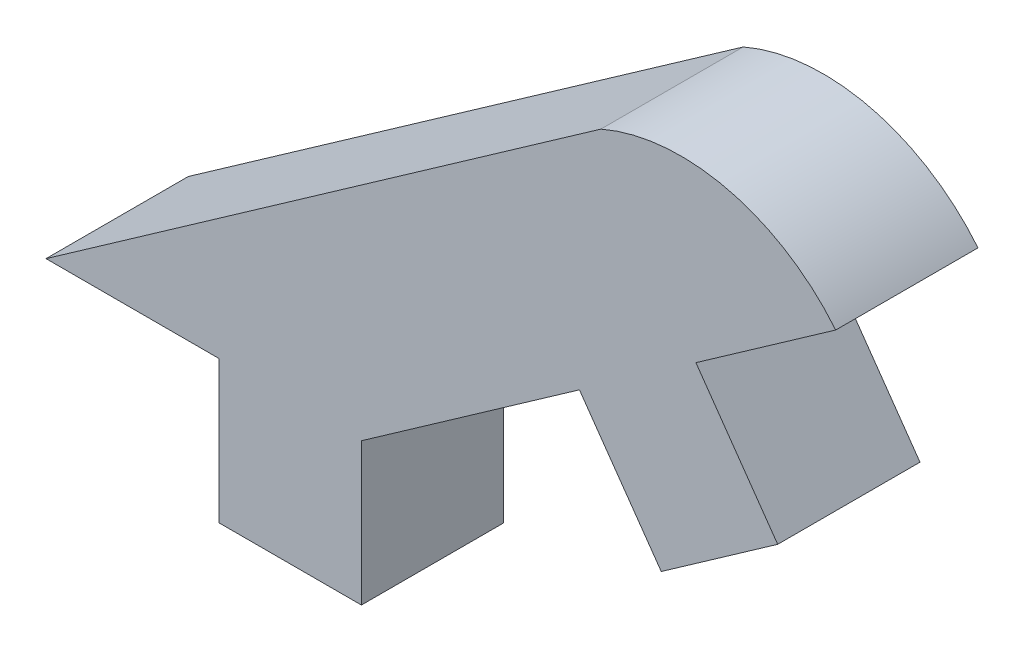
ISO-10303-21;
HEADER;
FILE_DESCRIPTION(('STEP AP214'),'2;1');
FILE_NAME('part.step','',(''),(''),'','','');
FILE_SCHEMA(('AUTOMOTIVE_DESIGN { 1 0 10303 214 1 1 1 1 }'));
ENDSEC;
DATA;
#1=APPLICATION_CONTEXT('core data for automotive mechanical design processes');
#2=APPLICATION_PROTOCOL_DEFINITION('international standard','automotive_design',2000,#1);
#3=PRODUCT_CONTEXT('',#1,'mechanical');
#4=PRODUCT('Part','Part','',(#3));
#5=PRODUCT_RELATED_PRODUCT_CATEGORY('part','',(#4));
#6=PRODUCT_DEFINITION_FORMATION('','',#4);
#7=PRODUCT_DEFINITION_CONTEXT('part definition',#1,'design');
#8=PRODUCT_DEFINITION('design','',#6,#7);
#9=PRODUCT_DEFINITION_SHAPE('','',#8);
#10=(LENGTH_UNIT() NAMED_UNIT(*) SI_UNIT(.MILLI.,.METRE.));
#11=(NAMED_UNIT(*) PLANE_ANGLE_UNIT() SI_UNIT($,.RADIAN.));
#12=(NAMED_UNIT(*) SI_UNIT($,.STERADIAN.) SOLID_ANGLE_UNIT());
#13=UNCERTAINTY_MEASURE_WITH_UNIT(LENGTH_MEASURE(1.E-05),#10,'distance_accuracy_value','');
#14=(GEOMETRIC_REPRESENTATION_CONTEXT(3) GLOBAL_UNCERTAINTY_ASSIGNED_CONTEXT((#13)) GLOBAL_UNIT_ASSIGNED_CONTEXT((#10,
#11,#12)) REPRESENTATION_CONTEXT('',''));
#15=CARTESIAN_POINT('',(0.,0.,0.));
#16=DIRECTION('',(0.,0.,1.));
#17=DIRECTION('',(1.,0.,0.));
#18=AXIS2_PLACEMENT_3D('',#15,#16,#17);
#19=CARTESIAN_POINT('',(26.7035857156091,0.,1.524));
#20=DIRECTION('',(0.,1.,0.));
#21=DIRECTION('',(0.,0.,1.));
#22=AXIS2_PLACEMENT_3D('',#19,#20,#21);
#23=PLANE('',#22);
#24=DIRECTION('',(1.,0.,0.));
#25=VECTOR('',#24,1.);
#26=CARTESIAN_POINT('',(26.7035857156091,0.,0.));
#27=LINE('',#26,#25);
#28=CARTESIAN_POINT('',(24.8496568898418,0.,0.));
#29=VERTEX_POINT('',#28);
#30=CARTESIAN_POINT('',(26.7035857156091,0.,0.));
#31=VERTEX_POINT('',#30);
#32=EDGE_CURVE('E148',#29,#31,#27,.T.);
#33=ORIENTED_EDGE('',*,*,#32,.T.);
#34=DIRECTION('',(0.,0.,-1.));
#35=VECTOR('',#34,1.);
#36=CARTESIAN_POINT('',(26.7035857156091,0.,1.524));
#37=LINE('',#36,#35);
#38=CARTESIAN_POINT('',(26.7035857156091,0.,1.524));
#39=VERTEX_POINT('',#38);
#40=EDGE_CURVE('E11',#39,#31,#37,.T.);
#41=ORIENTED_EDGE('',*,*,#40,.F.);
#42=DIRECTION('',(1.,0.,0.));
#43=VECTOR('',#42,1.);
#44=CARTESIAN_POINT('',(26.7035857156091,0.,1.524));
#45=LINE('',#44,#43);
#46=CARTESIAN_POINT('',(24.8496568898418,0.,1.524));
#47=VERTEX_POINT('',#46);
#48=EDGE_CURVE('E168',#47,#39,#45,.T.);
#49=ORIENTED_EDGE('',*,*,#48,.F.);
#50=DIRECTION('',(0.,0.,-1.));
#51=VECTOR('',#50,1.);
#52=CARTESIAN_POINT('',(24.8496568898418,0.,1.524));
#53=LINE('',#52,#51);
#54=EDGE_CURVE('E144',#47,#29,#53,.T.);
#55=ORIENTED_EDGE('',*,*,#54,.T.);
#56=EDGE_LOOP('',(#33,#41,#49,#55));
#57=FACE_BOUND('',#56,.T.);
#58=ADVANCED_FACE('F34',(#57),#23,.F.);
#59=CARTESIAN_POINT('',(26.7035857156091,0.,1.524));
#60=DIRECTION('',(1.,0.,0.));
#61=DIRECTION('',(0.,0.,-1.));
#62=AXIS2_PLACEMENT_3D('',#59,#60,#61);
#63=PLANE('',#62);
#64=DIRECTION('',(0.,-1.,0.));
#65=VECTOR('',#64,1.);
#66=CARTESIAN_POINT('',(26.7035857156091,0.,0.));
#67=LINE('',#66,#65);
#68=CARTESIAN_POINT('',(26.7035857156091,-1.524,0.));
#69=VERTEX_POINT('',#68);
#70=EDGE_CURVE('E151',#31,#69,#67,.T.);
#71=ORIENTED_EDGE('',*,*,#70,.T.);
#72=DIRECTION('',(0.,0.,-1.));
#73=VECTOR('',#72,1.);
#74=CARTESIAN_POINT('',(26.7035857156091,-1.524,1.524));
#75=LINE('',#74,#73);
#76=CARTESIAN_POINT('',(26.7035857156091,-1.524,1.524));
#77=VERTEX_POINT('',#76);
#78=EDGE_CURVE('E42',#77,#69,#75,.T.);
#79=ORIENTED_EDGE('',*,*,#78,.F.);
#80=DIRECTION('',(0.,-1.,0.));
#81=VECTOR('',#80,1.);
#82=CARTESIAN_POINT('',(26.7035857156091,0.,1.524));
#83=LINE('',#82,#81);
#84=EDGE_CURVE('E102',#39,#77,#83,.T.);
#85=ORIENTED_EDGE('',*,*,#84,.F.);
#86=ORIENTED_EDGE('',*,*,#40,.T.);
#87=EDGE_LOOP('',(#71,#79,#85,#86));
#88=FACE_BOUND('',#87,.T.);
#89=ADVANCED_FACE('F240',(#88),#63,.F.);
#90=CARTESIAN_POINT('',(26.7035857156091,-1.524,1.524));
#91=DIRECTION('',(0.,1.,0.));
#92=DIRECTION('',(0.,0.,1.));
#93=AXIS2_PLACEMENT_3D('',#90,#91,#92);
#94=PLANE('',#93);
#95=DIRECTION('',(1.,0.,0.));
#96=VECTOR('',#95,1.);
#97=CARTESIAN_POINT('',(26.7035857156091,-1.524,0.));
#98=LINE('',#97,#96);
#99=CARTESIAN_POINT('',(28.2275857156091,-1.524,0.));
#100=VERTEX_POINT('',#99);
#101=EDGE_CURVE('E153',#69,#100,#98,.T.);
#102=ORIENTED_EDGE('',*,*,#101,.T.);
#103=DIRECTION('',(0.,0.,-1.));
#104=VECTOR('',#103,1.);
#105=CARTESIAN_POINT('',(28.2275857156091,-1.524,1.524));
#106=LINE('',#105,#104);
#107=CARTESIAN_POINT('',(28.2275857156091,-1.524,1.524));
#108=VERTEX_POINT('',#107);
#109=EDGE_CURVE('E184',#108,#100,#106,.T.);
#110=ORIENTED_EDGE('',*,*,#109,.F.);
#111=DIRECTION('',(1.,0.,0.));
#112=VECTOR('',#111,1.);
#113=CARTESIAN_POINT('',(26.7035857156091,-1.524,1.524));
#114=LINE('',#113,#112);
#115=EDGE_CURVE('E192',#77,#108,#114,.T.);
#116=ORIENTED_EDGE('',*,*,#115,.F.);
#117=ORIENTED_EDGE('',*,*,#78,.T.);
#118=EDGE_LOOP('',(#102,#110,#116,#117));
#119=FACE_BOUND('',#118,.T.);
#120=ADVANCED_FACE('F190',(#119),#94,.F.);
#121=CARTESIAN_POINT('',(28.2275857156091,-1.524,1.524));
#122=DIRECTION('',(-1.,0.,0.));
#123=DIRECTION('',(0.,0.,1.));
#124=AXIS2_PLACEMENT_3D('',#121,#122,#123);
#125=PLANE('',#124);
#126=DIRECTION('',(0.,1.,0.));
#127=VECTOR('',#126,1.);
#128=CARTESIAN_POINT('',(28.2275857156091,-1.524,0.));
#129=LINE('',#128,#127);
#130=CARTESIAN_POINT('',(28.2275857156091,0.,0.));
#131=VERTEX_POINT('',#130);
#132=EDGE_CURVE('E155',#100,#131,#129,.T.);
#133=ORIENTED_EDGE('',*,*,#132,.T.);
#134=DIRECTION('',(0.,0.,-1.));
#135=VECTOR('',#134,1.);
#136=CARTESIAN_POINT('',(28.2275857156091,0.,1.524));
#137=LINE('',#136,#135);
#138=CARTESIAN_POINT('',(28.2275857156091,0.,1.524));
#139=VERTEX_POINT('',#138);
#140=EDGE_CURVE('E181',#139,#131,#137,.T.);
#141=ORIENTED_EDGE('',*,*,#140,.F.);
#142=DIRECTION('',(0.,1.,0.));
#143=VECTOR('',#142,1.);
#144=CARTESIAN_POINT('',(28.2275857156091,-1.524,1.524));
#145=LINE('',#144,#143);
#146=EDGE_CURVE('E210',#108,#139,#145,.T.);
#147=ORIENTED_EDGE('',*,*,#146,.F.);
#148=ORIENTED_EDGE('',*,*,#109,.T.);
#149=EDGE_LOOP('',(#133,#141,#147,#148));
#150=FACE_BOUND('',#149,.T.);
#151=ADVANCED_FACE('F201',(#150),#125,.F.);
#152=CARTESIAN_POINT('',(28.2275857156091,0.,1.524));
#153=DIRECTION('',(-0.574647327219023,0.818401154275843,0.));
#154=DIRECTION('',(-0.818401154275843,-0.574647327219023,0.));
#155=AXIS2_PLACEMENT_3D('',#152,#153,#154);
#156=PLANE('',#155);
#157=DIRECTION('',(0.818401154275843,0.574647327219023,0.));
#158=VECTOR('',#157,1.);
#159=CARTESIAN_POINT('',(28.2275857156091,0.,0.));
#160=LINE('',#159,#158);
#161=CARTESIAN_POINT('',(30.5627544392451,1.63965856918935,0.));
#162=VERTEX_POINT('',#161);
#163=EDGE_CURVE('E157',#131,#162,#160,.T.);
#164=ORIENTED_EDGE('',*,*,#163,.T.);
#165=DIRECTION('',(0.,0.,-1.));
#166=VECTOR('',#165,1.);
#167=CARTESIAN_POINT('',(30.5627544392451,1.63965856918935,1.524));
#168=LINE('',#167,#166);
#169=CARTESIAN_POINT('',(30.5627544392451,1.63965856918935,1.524));
#170=VERTEX_POINT('',#169);
#171=EDGE_CURVE('E178',#170,#162,#168,.T.);
#172=ORIENTED_EDGE('',*,*,#171,.F.);
#173=DIRECTION('',(0.818401154275843,0.574647327219023,0.));
#174=VECTOR('',#173,1.);
#175=CARTESIAN_POINT('',(28.2275857156091,0.,1.524));
#176=LINE('',#175,#174);
#177=EDGE_CURVE('E207',#139,#170,#176,.T.);
#178=ORIENTED_EDGE('',*,*,#177,.F.);
#179=ORIENTED_EDGE('',*,*,#140,.T.);
#180=EDGE_LOOP('',(#164,#172,#178,#179));
#181=FACE_BOUND('',#180,.T.);
#182=ADVANCED_FACE('F205',(#181),#156,.F.);
#183=CARTESIAN_POINT('',(30.5627544392451,1.63965856918935,1.524));
#184=DIRECTION('',(0.818401154275843,0.574647327219023,0.));
#185=DIRECTION('',(-0.574647327219023,0.818401154275843,0.));
#186=AXIS2_PLACEMENT_3D('',#183,#184,#185);
#187=PLANE('',#186);
#188=DIRECTION('',(0.574647327219023,-0.818401154275843,0.));
#189=VECTOR('',#188,1.);
#190=CARTESIAN_POINT('',(30.5627544392451,1.63965856918935,0.));
#191=LINE('',#190,#189);
#192=CARTESIAN_POINT('',(31.4385169659268,0.392415210072967,0.));
#193=VERTEX_POINT('',#192);
#194=EDGE_CURVE('E159',#162,#193,#191,.T.);
#195=ORIENTED_EDGE('',*,*,#194,.T.);
#196=DIRECTION('',(0.,0.,-1.));
#197=VECTOR('',#196,1.);
#198=CARTESIAN_POINT('',(31.4385169659268,0.392415210072967,1.524));
#199=LINE('',#198,#197);
#200=CARTESIAN_POINT('',(31.4385169659268,0.392415210072967,1.524));
#201=VERTEX_POINT('',#200);
#202=EDGE_CURVE('E175',#201,#193,#199,.T.);
#203=ORIENTED_EDGE('',*,*,#202,.F.);
#204=DIRECTION('',(0.574647327219023,-0.818401154275843,0.));
#205=VECTOR('',#204,1.);
#206=CARTESIAN_POINT('',(30.5627544392451,1.63965856918935,1.524));
#207=LINE('',#206,#205);
#208=EDGE_CURVE('E209',#170,#201,#207,.T.);
#209=ORIENTED_EDGE('',*,*,#208,.F.);
#210=ORIENTED_EDGE('',*,*,#171,.T.);
#211=EDGE_LOOP('',(#195,#203,#209,#210));
#212=FACE_BOUND('',#211,.T.);
#213=ADVANCED_FACE('F253',(#212),#187,.F.);
#214=CARTESIAN_POINT('',(31.4385169659268,0.392415210072967,1.524));
#215=DIRECTION('',(-0.574647327219024,0.818401154275843,0.));
#216=DIRECTION('',(-0.818401154275843,-0.574647327219024,0.));
#217=AXIS2_PLACEMENT_3D('',#214,#215,#216);
#218=PLANE('',#217);
#219=DIRECTION('',(0.818401154275843,0.574647327219024,0.));
#220=VECTOR('',#219,1.);
#221=CARTESIAN_POINT('',(31.4385169659268,0.392415210072967,0.));
#222=LINE('',#221,#220);
#223=CARTESIAN_POINT('',(32.6857603250432,1.26817773675476,0.));
#224=VERTEX_POINT('',#223);
#225=EDGE_CURVE('E161',#193,#224,#222,.T.);
#226=ORIENTED_EDGE('',*,*,#225,.T.);
#227=DIRECTION('',(0.,0.,-1.));
#228=VECTOR('',#227,1.);
#229=CARTESIAN_POINT('',(32.6857603250432,1.26817773675476,1.524));
#230=LINE('',#229,#228);
#231=CARTESIAN_POINT('',(32.6857603250432,1.26817773675476,1.524));
#232=VERTEX_POINT('',#231);
#233=EDGE_CURVE('E172',#232,#224,#230,.T.);
#234=ORIENTED_EDGE('',*,*,#233,.F.);
#235=DIRECTION('',(0.818401154275843,0.574647327219024,0.));
#236=VECTOR('',#235,1.);
#237=CARTESIAN_POINT('',(31.4385169659268,0.392415210072967,1.524));
#238=LINE('',#237,#236);
#239=EDGE_CURVE('E212',#201,#232,#238,.T.);
#240=ORIENTED_EDGE('',*,*,#239,.F.);
#241=ORIENTED_EDGE('',*,*,#202,.T.);
#242=EDGE_LOOP('',(#226,#234,#240,#241));
#243=FACE_BOUND('',#242,.T.);
#244=ADVANCED_FACE('F221',(#243),#218,.F.);
#245=CARTESIAN_POINT('',(32.6857603250432,1.26817773675476,1.524));
#246=DIRECTION('',(-0.818401154275844,-0.574647327219022,0.));
#247=DIRECTION('',(0.574647327219022,-0.818401154275844,0.));
#248=AXIS2_PLACEMENT_3D('',#245,#246,#247);
#249=PLANE('',#248);
#250=DIRECTION('',(-0.574647327219022,0.818401154275844,0.));
#251=VECTOR('',#250,1.);
#252=CARTESIAN_POINT('',(32.6857603250432,1.26817773675476,0.));
#253=LINE('',#252,#251);
#254=CARTESIAN_POINT('',(31.8099977983614,2.51542109587115,0.));
#255=VERTEX_POINT('',#254);
#256=EDGE_CURVE('E163',#224,#255,#253,.T.);
#257=ORIENTED_EDGE('',*,*,#256,.T.);
#258=DIRECTION('',(0.,0.,-1.));
#259=VECTOR('',#258,1.);
#260=CARTESIAN_POINT('',(31.8099977983614,2.51542109587115,1.524));
#261=LINE('',#260,#259);
#262=CARTESIAN_POINT('',(31.8099977983614,2.51542109587115,1.524));
#263=VERTEX_POINT('',#262);
#264=EDGE_CURVE('E139',#263,#255,#261,.T.);
#265=ORIENTED_EDGE('',*,*,#264,.F.);
#266=DIRECTION('',(-0.574647327219022,0.818401154275844,0.));
#267=VECTOR('',#266,1.);
#268=CARTESIAN_POINT('',(32.6857603250432,1.26817773675476,1.524));
#269=LINE('',#268,#267);
#270=EDGE_CURVE('E130',#232,#263,#269,.T.);
#271=ORIENTED_EDGE('',*,*,#270,.F.);
#272=ORIENTED_EDGE('',*,*,#233,.T.);
#273=EDGE_LOOP('',(#257,#265,#271,#272));
#274=FACE_BOUND('',#273,.T.);
#275=ADVANCED_FACE('F225',(#274),#249,.F.);
#276=CARTESIAN_POINT('',(31.8099977983614,2.51542109587115,1.524));
#277=DIRECTION('',(-0.574647327219024,0.818401154275843,0.));
#278=DIRECTION('',(-0.818401154275843,-0.574647327219024,0.));
#279=AXIS2_PLACEMENT_3D('',#276,#277,#278);
#280=PLANE('',#279);
#281=DIRECTION('',(0.818401154275843,0.574647327219024,0.));
#282=VECTOR('',#281,1.);
#283=CARTESIAN_POINT('',(31.8099977983614,2.51542109587115,0.));
#284=LINE('',#283,#282);
#285=CARTESIAN_POINT('',(33.3069658175326,3.56652991537204,0.));
#286=VERTEX_POINT('',#285);
#287=EDGE_CURVE('E138',#255,#286,#284,.T.);
#288=ORIENTED_EDGE('',*,*,#287,.T.);
#289=DIRECTION('',(0.,0.,-1.));
#290=VECTOR('',#289,1.);
#291=CARTESIAN_POINT('',(33.3069658175326,3.56652991537204,1.524));
#292=LINE('',#291,#290);
#293=CARTESIAN_POINT('',(33.3069658175326,3.56652991537204,1.524));
#294=VERTEX_POINT('',#293);
#295=EDGE_CURVE('E135',#294,#286,#292,.T.);
#296=ORIENTED_EDGE('',*,*,#295,.F.);
#297=DIRECTION('',(0.818401154275843,0.574647327219024,0.));
#298=VECTOR('',#297,1.);
#299=CARTESIAN_POINT('',(31.8099977983614,2.51542109587115,1.524));
#300=LINE('',#299,#298);
#301=EDGE_CURVE('E124',#263,#294,#300,.T.);
#302=ORIENTED_EDGE('',*,*,#301,.F.);
#303=ORIENTED_EDGE('',*,*,#264,.T.);
#304=EDGE_LOOP('',(#288,#296,#302,#303));
#305=FACE_BOUND('',#304,.T.);
#306=ADVANCED_FACE('F136',(#305),#280,.F.);
#307=CARTESIAN_POINT('',(31.6507784793167,2.21503572462214,1.524));
#308=DIRECTION('',(0.,0.,-1.));
#309=DIRECTION('',(-1.,0.,0.));
#310=AXIS2_PLACEMENT_3D('',#307,#308,#309);
#311=CYLINDRICAL_SURFACE('',#310,2.13763725802519);
#312=CARTESIAN_POINT('',(31.6507784793167,2.21503572462214,0.));
#313=DIRECTION('',(0.,0.,1.));
#314=DIRECTION('',(1.,0.,0.));
#315=AXIS2_PLACEMENT_3D('',#312,#313,#314);
#316=CIRCLE('',#315,2.13763725802519);
#317=CARTESIAN_POINT('',(30.7924423059396,4.17277729601755,0.));
#318=VERTEX_POINT('',#317);
#319=EDGE_CURVE('E88',#286,#318,#316,.T.);
#320=ORIENTED_EDGE('',*,*,#319,.T.);
#321=DIRECTION('',(0.,0.,-1.));
#322=VECTOR('',#321,1.);
#323=CARTESIAN_POINT('',(30.7924423059396,4.17277729601755,1.524));
#324=LINE('',#323,#322);
#325=CARTESIAN_POINT('',(30.7924423059396,4.17277729601755,1.524));
#326=VERTEX_POINT('',#325);
#327=EDGE_CURVE('E140',#326,#318,#324,.T.);
#328=ORIENTED_EDGE('',*,*,#327,.F.);
#329=CARTESIAN_POINT('',(31.6507784793167,2.21503572462214,1.524));
#330=DIRECTION('',(0.,0.,1.));
#331=DIRECTION('',(1.,0.,0.));
#332=AXIS2_PLACEMENT_3D('',#329,#330,#331);
#333=CIRCLE('',#332,2.13763725802519);
#334=EDGE_CURVE('E128',#294,#326,#333,.T.);
#335=ORIENTED_EDGE('',*,*,#334,.F.);
#336=ORIENTED_EDGE('',*,*,#295,.T.);
#337=EDGE_LOOP('',(#320,#328,#335,#336));
#338=FACE_BOUND('',#337,.T.);
#339=ADVANCED_FACE('F142',(#338),#311,.T.);
#340=CARTESIAN_POINT('',(24.8496568898418,0.,1.524));
#341=DIRECTION('',(0.574647327219023,-0.818401154275843,0.));
#342=DIRECTION('',(0.818401154275843,0.574647327219023,0.));
#343=AXIS2_PLACEMENT_3D('',#340,#341,#342);
#344=PLANE('',#343);
#345=DIRECTION('',(-0.818401154275843,-0.574647327219023,0.));
#346=VECTOR('',#345,1.);
#347=CARTESIAN_POINT('',(24.8496568898418,0.,0.));
#348=LINE('',#347,#346);
#349=EDGE_CURVE('E94',#318,#29,#348,.T.);
#350=ORIENTED_EDGE('',*,*,#349,.T.);
#351=ORIENTED_EDGE('',*,*,#54,.F.);
#352=DIRECTION('',(-0.818401154275843,-0.574647327219023,0.));
#353=VECTOR('',#352,1.);
#354=CARTESIAN_POINT('',(24.8496568898418,0.,1.524));
#355=LINE('',#354,#353);
#356=EDGE_CURVE('E50',#326,#47,#355,.T.);
#357=ORIENTED_EDGE('',*,*,#356,.F.);
#358=ORIENTED_EDGE('',*,*,#327,.T.);
#359=EDGE_LOOP('',(#350,#351,#357,#358));
#360=FACE_BOUND('',#359,.T.);
#361=ADVANCED_FACE('F229',(#360),#344,.F.);
#362=CARTESIAN_POINT('',(31.6507784793167,2.21503572462214,1.524));
#363=DIRECTION('',(0.,0.,1.));
#364=DIRECTION('',(1.,0.,0.));
#365=AXIS2_PLACEMENT_3D('',#362,#363,#364);
#366=PLANE('',#365);
#367=ORIENTED_EDGE('',*,*,#48,.T.);
#368=ORIENTED_EDGE('',*,*,#84,.T.);
#369=ORIENTED_EDGE('',*,*,#115,.T.);
#370=ORIENTED_EDGE('',*,*,#146,.T.);
#371=ORIENTED_EDGE('',*,*,#177,.T.);
#372=ORIENTED_EDGE('',*,*,#208,.T.);
#373=ORIENTED_EDGE('',*,*,#239,.T.);
#374=ORIENTED_EDGE('',*,*,#270,.T.);
#375=ORIENTED_EDGE('',*,*,#301,.T.);
#376=ORIENTED_EDGE('',*,*,#334,.T.);
#377=ORIENTED_EDGE('',*,*,#356,.T.);
#378=EDGE_LOOP('',(#367,#368,#369,#370,#371,#372,#373,#374,#375,#376,#377));
#379=FACE_BOUND('',#378,.T.);
#380=ADVANCED_FACE('F126',(#379),#366,.T.);
#381=CARTESIAN_POINT('',(31.6507784793167,2.21503572462214,0.));
#382=DIRECTION('',(0.,0.,1.));
#383=DIRECTION('',(1.,0.,0.));
#384=AXIS2_PLACEMENT_3D('',#381,#382,#383);
#385=PLANE('',#384);
#386=ORIENTED_EDGE('',*,*,#32,.F.);
#387=ORIENTED_EDGE('',*,*,#349,.F.);
#388=ORIENTED_EDGE('',*,*,#319,.F.);
#389=ORIENTED_EDGE('',*,*,#287,.F.);
#390=ORIENTED_EDGE('',*,*,#256,.F.);
#391=ORIENTED_EDGE('',*,*,#225,.F.);
#392=ORIENTED_EDGE('',*,*,#194,.F.);
#393=ORIENTED_EDGE('',*,*,#163,.F.);
#394=ORIENTED_EDGE('',*,*,#132,.F.);
#395=ORIENTED_EDGE('',*,*,#101,.F.);
#396=ORIENTED_EDGE('',*,*,#70,.F.);
#397=EDGE_LOOP('',(#386,#387,#388,#389,#390,#391,#392,#393,#394,#395,#396));
#398=FACE_BOUND('',#397,.T.);
#399=ADVANCED_FACE('F196',(#398),#385,.F.);
#400=CLOSED_SHELL('',(#58,#89,#120,#151,#182,#213,#244,#275,#306,#339,#361,#380,#399));
#401=MANIFOLD_SOLID_BREP('B2',#400);
#402=ADVANCED_BREP_SHAPE_REPRESENTATION('',(#18,#401),#14);
#403=SHAPE_DEFINITION_REPRESENTATION(#9,#402);
ENDSEC;
END-ISO-10303-21;
